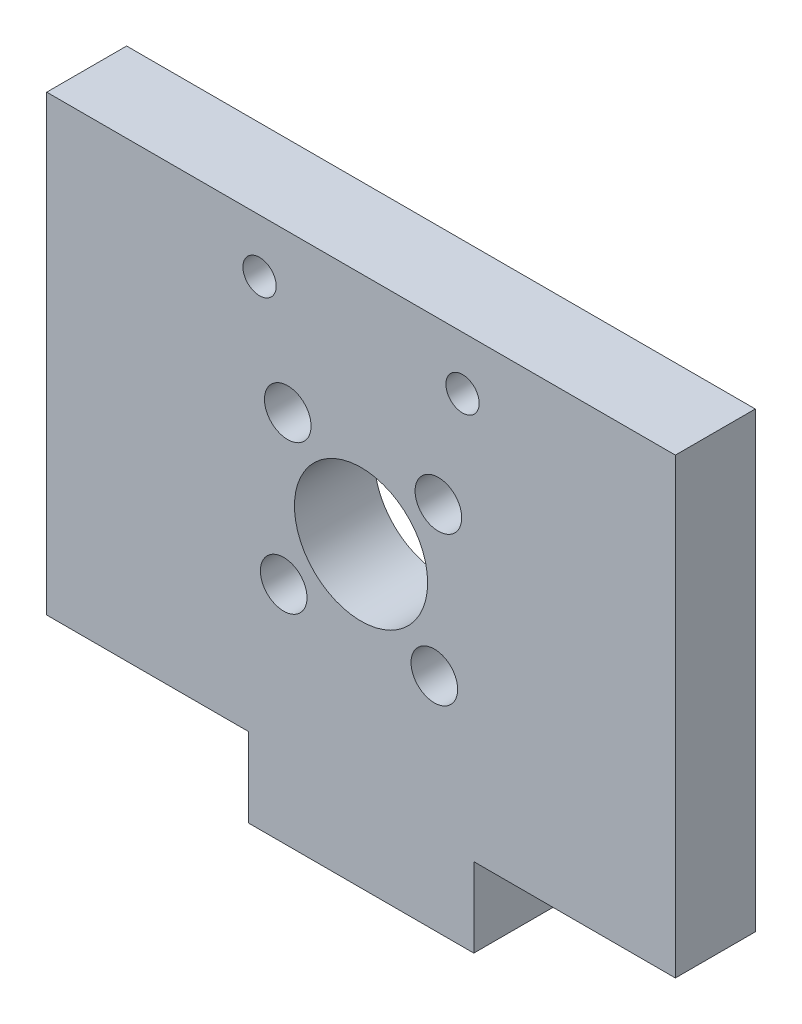
ISO-10303-21;
HEADER;
FILE_DESCRIPTION(('STEP AP214'),'2;1');
FILE_NAME('part.step','',(''),(''),'','','');
FILE_SCHEMA(('AUTOMOTIVE_DESIGN { 1 0 10303 214 1 1 1 1 }'));
ENDSEC;
DATA;
#1=APPLICATION_CONTEXT('core data for automotive mechanical design processes');
#2=APPLICATION_PROTOCOL_DEFINITION('international standard','automotive_design',2000,#1);
#3=PRODUCT_CONTEXT('',#1,'mechanical');
#4=PRODUCT('Part','Part','',(#3));
#5=PRODUCT_RELATED_PRODUCT_CATEGORY('part','',(#4));
#6=PRODUCT_DEFINITION_FORMATION('','',#4);
#7=PRODUCT_DEFINITION_CONTEXT('part definition',#1,'design');
#8=PRODUCT_DEFINITION('design','',#6,#7);
#9=PRODUCT_DEFINITION_SHAPE('','',#8);
#10=(LENGTH_UNIT() NAMED_UNIT(*) SI_UNIT(.MILLI.,.METRE.));
#11=(NAMED_UNIT(*) PLANE_ANGLE_UNIT() SI_UNIT($,.RADIAN.));
#12=(NAMED_UNIT(*) SI_UNIT($,.STERADIAN.) SOLID_ANGLE_UNIT());
#13=UNCERTAINTY_MEASURE_WITH_UNIT(LENGTH_MEASURE(1.E-05),#10,'distance_accuracy_value','');
#14=(GEOMETRIC_REPRESENTATION_CONTEXT(3) GLOBAL_UNCERTAINTY_ASSIGNED_CONTEXT((#13)) GLOBAL_UNIT_ASSIGNED_CONTEXT((#10,
#11,#12)) REPRESENTATION_CONTEXT('',''));
#15=CARTESIAN_POINT('',(0.,0.,0.));
#16=DIRECTION('',(0.,0.,1.));
#17=DIRECTION('',(1.,0.,0.));
#18=AXIS2_PLACEMENT_3D('',#15,#16,#17);
#19=CARTESIAN_POINT('',(0.,0.,6.));
#20=DIRECTION('',(0.,0.,1.));
#21=DIRECTION('',(1.,0.,0.));
#22=AXIS2_PLACEMENT_3D('',#19,#20,#21);
#23=PLANE('',#22);
#24=CARTESIAN_POINT('',(332.936937195696,256.998518153976,6.));
#25=DIRECTION('',(0.,0.,1.));
#26=DIRECTION('',(1.,0.,0.));
#27=AXIS2_PLACEMENT_3D('',#24,#25,#26);
#28=CIRCLE('',#27,1.24999999999996);
#29=CARTESIAN_POINT('',(334.186937195696,256.998518153976,6.));
#30=VERTEX_POINT('',#29);
#31=EDGE_CURVE('E217',#30,#30,#28,.T.);
#32=ORIENTED_EDGE('',*,*,#31,.F.);
#33=EDGE_LOOP('',(#32));
#34=FACE_BOUND('',#33,.T.);
#35=CARTESIAN_POINT('',(317.696937195697,256.998518153976,6.));
#36=DIRECTION('',(0.,0.,1.));
#37=DIRECTION('',(1.,0.,0.));
#38=AXIS2_PLACEMENT_3D('',#35,#36,#37);
#39=CIRCLE('',#38,1.24999999999996);
#40=CARTESIAN_POINT('',(318.946937195696,256.998518153976,6.));
#41=VERTEX_POINT('',#40);
#42=EDGE_CURVE('E211',#41,#41,#39,.T.);
#43=ORIENTED_EDGE('',*,*,#42,.F.);
#44=EDGE_LOOP('',(#43));
#45=FACE_BOUND('',#44,.T.);
#46=CARTESIAN_POINT('',(319.509928142575,237.895914601387,6.));
#47=DIRECTION('',(0.,0.,1.));
#48=DIRECTION('',(1.,0.,0.));
#49=AXIS2_PLACEMENT_3D('',#46,#47,#48);
#50=CIRCLE('',#49,1.74999999999992);
#51=CARTESIAN_POINT('',(321.259928142575,237.895914601387,6.));
#52=VERTEX_POINT('',#51);
#53=EDGE_CURVE('E194',#52,#52,#50,.T.);
#54=ORIENTED_EDGE('',*,*,#53,.F.);
#55=EDGE_LOOP('',(#54));
#56=FACE_BOUND('',#55,.T.);
#57=CARTESIAN_POINT('',(331.123946248819,248.901121706565,6.));
#58=DIRECTION('',(0.,0.,1.));
#59=DIRECTION('',(1.,0.,0.));
#60=AXIS2_PLACEMENT_3D('',#57,#58,#59);
#61=CIRCLE('',#60,1.75000000000008);
#62=CARTESIAN_POINT('',(332.873946248819,248.901121706565,6.));
#63=VERTEX_POINT('',#62);
#64=EDGE_CURVE('E182',#63,#63,#61,.T.);
#65=ORIENTED_EDGE('',*,*,#64,.F.);
#66=EDGE_LOOP('',(#65));
#67=FACE_BOUND('',#66,.T.);
#68=DIRECTION('',(1.,0.,0.));
#69=VECTOR('',#68,1.);
#70=CARTESIAN_POINT('',(333.783603862363,226.998518153976,6.));
#71=LINE('',#70,#69);
#72=CARTESIAN_POINT('',(333.783603862363,226.998518153976,6.));
#73=VERTEX_POINT('',#72);
#74=CARTESIAN_POINT('',(348.916937195697,226.998518153976,6.));
#75=VERTEX_POINT('',#74);
#76=EDGE_CURVE('E145',#73,#75,#71,.T.);
#77=ORIENTED_EDGE('',*,*,#76,.T.);
#78=DIRECTION('',(0.,1.,0.));
#79=VECTOR('',#78,1.);
#80=CARTESIAN_POINT('',(348.916937195697,226.998518153976,6.));
#81=LINE('',#80,#79);
#82=CARTESIAN_POINT('',(348.916937195697,260.998518153976,6.));
#83=VERTEX_POINT('',#82);
#84=EDGE_CURVE('E93',#75,#83,#81,.T.);
#85=ORIENTED_EDGE('',*,*,#84,.T.);
#86=DIRECTION('',(-1.,0.,0.));
#87=VECTOR('',#86,1.);
#88=CARTESIAN_POINT('',(348.916937195697,260.998518153976,6.));
#89=LINE('',#88,#87);
#90=CARTESIAN_POINT('',(301.716937195697,260.998518153976,6.));
#91=VERTEX_POINT('',#90);
#92=EDGE_CURVE('E160',#83,#91,#89,.T.);
#93=ORIENTED_EDGE('',*,*,#92,.T.);
#94=DIRECTION('',(0.,-1.,0.));
#95=VECTOR('',#94,1.);
#96=CARTESIAN_POINT('',(301.716937195697,260.998518153976,6.));
#97=LINE('',#96,#95);
#98=CARTESIAN_POINT('',(301.716937195697,226.998518153976,6.));
#99=VERTEX_POINT('',#98);
#100=EDGE_CURVE('E173',#91,#99,#97,.T.);
#101=ORIENTED_EDGE('',*,*,#100,.T.);
#102=DIRECTION('',(1.,0.,0.));
#103=VECTOR('',#102,1.);
#104=CARTESIAN_POINT('',(301.716937195697,226.998518153976,6.));
#105=LINE('',#104,#103);
#106=CARTESIAN_POINT('',(316.85027052903,226.998518153976,6.));
#107=VERTEX_POINT('',#106);
#108=EDGE_CURVE('E112',#99,#107,#105,.T.);
#109=ORIENTED_EDGE('',*,*,#108,.T.);
#110=DIRECTION('',(0.,-1.,0.));
#111=VECTOR('',#110,1.);
#112=CARTESIAN_POINT('',(316.85027052903,226.998518153976,6.));
#113=LINE('',#112,#111);
#114=CARTESIAN_POINT('',(316.85027052903,221.049077869644,6.));
#115=VERTEX_POINT('',#114);
#116=EDGE_CURVE('E106',#107,#115,#113,.T.);
#117=ORIENTED_EDGE('',*,*,#116,.T.);
#118=DIRECTION('',(1.,0.,0.));
#119=VECTOR('',#118,1.);
#120=CARTESIAN_POINT('',(316.85027052903,221.049077869644,6.));
#121=LINE('',#120,#119);
#122=CARTESIAN_POINT('',(333.783603862363,221.049077869644,6.));
#123=VERTEX_POINT('',#122);
#124=EDGE_CURVE('E110',#115,#123,#121,.T.);
#125=ORIENTED_EDGE('',*,*,#124,.T.);
#126=DIRECTION('',(0.,1.,0.));
#127=VECTOR('',#126,1.);
#128=CARTESIAN_POINT('',(333.783603862363,221.049077869644,6.));
#129=LINE('',#128,#127);
#130=EDGE_CURVE('E50',#123,#73,#129,.T.);
#131=ORIENTED_EDGE('',*,*,#130,.T.);
#132=EDGE_LOOP('',(#77,#85,#93,#101,#109,#117,#125,#131));
#133=FACE_BOUND('',#132,.T.);
#134=CARTESIAN_POINT('',(325.316937195697,243.398518153976,6.));
#135=DIRECTION('',(0.,0.,1.));
#136=DIRECTION('',(1.,0.,0.));
#137=AXIS2_PLACEMENT_3D('',#134,#135,#136);
#138=CIRCLE('',#137,5.);
#139=CARTESIAN_POINT('',(330.316937195697,243.398518153976,6.));
#140=VERTEX_POINT('',#139);
#141=EDGE_CURVE('E134',#140,#140,#138,.T.);
#142=ORIENTED_EDGE('',*,*,#141,.F.);
#143=EDGE_LOOP('',(#142));
#144=FACE_BOUND('',#143,.T.);
#145=CARTESIAN_POINT('',(319.814333643109,249.205527207098,6.));
#146=DIRECTION('',(0.,0.,1.));
#147=DIRECTION('',(1.,0.,0.));
#148=AXIS2_PLACEMENT_3D('',#145,#146,#147);
#149=CIRCLE('',#148,1.75000000000002);
#150=CARTESIAN_POINT('',(321.564333643109,249.205527207098,6.));
#151=VERTEX_POINT('',#150);
#152=EDGE_CURVE('E188',#151,#151,#149,.T.);
#153=ORIENTED_EDGE('',*,*,#152,.F.);
#154=EDGE_LOOP('',(#153));
#155=FACE_BOUND('',#154,.T.);
#156=CARTESIAN_POINT('',(330.819540748286,237.591509100854,6.));
#157=DIRECTION('',(0.,0.,1.));
#158=DIRECTION('',(1.,0.,0.));
#159=AXIS2_PLACEMENT_3D('',#156,#157,#158);
#160=CIRCLE('',#159,1.75000000000001);
#161=CARTESIAN_POINT('',(332.569540748286,237.591509100854,6.));
#162=VERTEX_POINT('',#161);
#163=EDGE_CURVE('E200',#162,#162,#160,.T.);
#164=ORIENTED_EDGE('',*,*,#163,.F.);
#165=EDGE_LOOP('',(#164));
#166=FACE_BOUND('',#165,.T.);
#167=ADVANCED_FACE('F33',(#34,#45,#56,#67,#133,#144,#155,#166),#23,.T.);
#168=CARTESIAN_POINT('',(0.,0.,0.));
#169=DIRECTION('',(0.,0.,1.));
#170=DIRECTION('',(1.,0.,0.));
#171=AXIS2_PLACEMENT_3D('',#168,#169,#170);
#172=PLANE('',#171);
#173=CARTESIAN_POINT('',(332.936937195696,256.998518153976,0.));
#174=DIRECTION('',(0.,0.,1.));
#175=DIRECTION('',(1.,0.,0.));
#176=AXIS2_PLACEMENT_3D('',#173,#174,#175);
#177=CIRCLE('',#176,1.24999999999996);
#178=CARTESIAN_POINT('',(334.186937195696,256.998518153976,0.));
#179=VERTEX_POINT('',#178);
#180=EDGE_CURVE('E214',#179,#179,#177,.F.);
#181=ORIENTED_EDGE('',*,*,#180,.F.);
#182=EDGE_LOOP('',(#181));
#183=FACE_BOUND('',#182,.T.);
#184=CARTESIAN_POINT('',(317.696937195697,256.998518153976,0.));
#185=DIRECTION('',(0.,0.,1.));
#186=DIRECTION('',(1.,0.,0.));
#187=AXIS2_PLACEMENT_3D('',#184,#185,#186);
#188=CIRCLE('',#187,1.24999999999996);
#189=CARTESIAN_POINT('',(318.946937195696,256.998518153976,0.));
#190=VERTEX_POINT('',#189);
#191=EDGE_CURVE('E206',#190,#190,#188,.F.);
#192=ORIENTED_EDGE('',*,*,#191,.F.);
#193=EDGE_LOOP('',(#192));
#194=FACE_BOUND('',#193,.T.);
#195=DIRECTION('',(1.,0.,0.));
#196=VECTOR('',#195,1.);
#197=CARTESIAN_POINT('',(333.783603862363,226.998518153976,0.));
#198=LINE('',#197,#196);
#199=CARTESIAN_POINT('',(333.783603862363,226.998518153976,0.));
#200=VERTEX_POINT('',#199);
#201=CARTESIAN_POINT('',(348.916937195697,226.998518153976,0.));
#202=VERTEX_POINT('',#201);
#203=EDGE_CURVE('E130',#200,#202,#198,.T.);
#204=ORIENTED_EDGE('',*,*,#203,.F.);
#205=DIRECTION('',(0.,1.,0.));
#206=VECTOR('',#205,1.);
#207=CARTESIAN_POINT('',(333.783603862363,221.049077869644,0.));
#208=LINE('',#207,#206);
#209=CARTESIAN_POINT('',(333.783603862363,221.049077869644,0.));
#210=VERTEX_POINT('',#209);
#211=EDGE_CURVE('E85',#210,#200,#208,.T.);
#212=ORIENTED_EDGE('',*,*,#211,.F.);
#213=DIRECTION('',(1.,0.,0.));
#214=VECTOR('',#213,1.);
#215=CARTESIAN_POINT('',(316.85027052903,221.049077869644,0.));
#216=LINE('',#215,#214);
#217=CARTESIAN_POINT('',(316.85027052903,221.049077869644,0.));
#218=VERTEX_POINT('',#217);
#219=EDGE_CURVE('E79',#218,#210,#216,.T.);
#220=ORIENTED_EDGE('',*,*,#219,.F.);
#221=DIRECTION('',(0.,-1.,0.));
#222=VECTOR('',#221,1.);
#223=CARTESIAN_POINT('',(316.85027052903,226.998518153976,0.));
#224=LINE('',#223,#222);
#225=CARTESIAN_POINT('',(316.85027052903,226.998518153976,0.));
#226=VERTEX_POINT('',#225);
#227=EDGE_CURVE('E120',#226,#218,#224,.T.);
#228=ORIENTED_EDGE('',*,*,#227,.F.);
#229=DIRECTION('',(1.,0.,0.));
#230=VECTOR('',#229,1.);
#231=CARTESIAN_POINT('',(301.716937195697,226.998518153976,0.));
#232=LINE('',#231,#230);
#233=CARTESIAN_POINT('',(301.716937195697,226.998518153976,0.));
#234=VERTEX_POINT('',#233);
#235=EDGE_CURVE('E140',#234,#226,#232,.T.);
#236=ORIENTED_EDGE('',*,*,#235,.F.);
#237=DIRECTION('',(0.,-1.,0.));
#238=VECTOR('',#237,1.);
#239=CARTESIAN_POINT('',(301.716937195697,260.998518153976,0.));
#240=LINE('',#239,#238);
#241=CARTESIAN_POINT('',(301.716937195697,260.998518153976,0.));
#242=VERTEX_POINT('',#241);
#243=EDGE_CURVE('E138',#242,#234,#240,.T.);
#244=ORIENTED_EDGE('',*,*,#243,.F.);
#245=DIRECTION('',(-1.,0.,0.));
#246=VECTOR('',#245,1.);
#247=CARTESIAN_POINT('',(348.916937195697,260.998518153976,0.));
#248=LINE('',#247,#246);
#249=CARTESIAN_POINT('',(348.916937195697,260.998518153976,0.));
#250=VERTEX_POINT('',#249);
#251=EDGE_CURVE('E136',#250,#242,#248,.T.);
#252=ORIENTED_EDGE('',*,*,#251,.F.);
#253=DIRECTION('',(0.,1.,0.));
#254=VECTOR('',#253,1.);
#255=CARTESIAN_POINT('',(348.916937195697,226.998518153976,0.));
#256=LINE('',#255,#254);
#257=EDGE_CURVE('E133',#202,#250,#256,.T.);
#258=ORIENTED_EDGE('',*,*,#257,.F.);
#259=EDGE_LOOP('',(#204,#212,#220,#228,#236,#244,#252,#258));
#260=FACE_BOUND('',#259,.T.);
#261=CARTESIAN_POINT('',(325.316937195697,243.398518153976,0.));
#262=DIRECTION('',(0.,0.,1.));
#263=DIRECTION('',(1.,0.,0.));
#264=AXIS2_PLACEMENT_3D('',#261,#262,#263);
#265=CIRCLE('',#264,5.);
#266=CARTESIAN_POINT('',(330.316937195697,243.398518153976,0.));
#267=VERTEX_POINT('',#266);
#268=EDGE_CURVE('E179',#267,#267,#265,.T.);
#269=ORIENTED_EDGE('',*,*,#268,.T.);
#270=EDGE_LOOP('',(#269));
#271=FACE_BOUND('',#270,.T.);
#272=CARTESIAN_POINT('',(331.123946248819,248.901121706565,0.));
#273=DIRECTION('',(0.,0.,1.));
#274=DIRECTION('',(1.,0.,0.));
#275=AXIS2_PLACEMENT_3D('',#272,#273,#274);
#276=CIRCLE('',#275,1.75000000000008);
#277=CARTESIAN_POINT('',(332.873946248819,248.901121706565,0.));
#278=VERTEX_POINT('',#277);
#279=EDGE_CURVE('E185',#278,#278,#276,.T.);
#280=ORIENTED_EDGE('',*,*,#279,.T.);
#281=EDGE_LOOP('',(#280));
#282=FACE_BOUND('',#281,.T.);
#283=CARTESIAN_POINT('',(319.814333643109,249.205527207098,0.));
#284=DIRECTION('',(0.,0.,1.));
#285=DIRECTION('',(1.,0.,0.));
#286=AXIS2_PLACEMENT_3D('',#283,#284,#285);
#287=CIRCLE('',#286,1.75000000000002);
#288=CARTESIAN_POINT('',(321.564333643109,249.205527207098,0.));
#289=VERTEX_POINT('',#288);
#290=EDGE_CURVE('E191',#289,#289,#287,.T.);
#291=ORIENTED_EDGE('',*,*,#290,.T.);
#292=EDGE_LOOP('',(#291));
#293=FACE_BOUND('',#292,.T.);
#294=CARTESIAN_POINT('',(319.509928142575,237.895914601387,0.));
#295=DIRECTION('',(0.,0.,1.));
#296=DIRECTION('',(1.,0.,0.));
#297=AXIS2_PLACEMENT_3D('',#294,#295,#296);
#298=CIRCLE('',#297,1.74999999999992);
#299=CARTESIAN_POINT('',(321.259928142575,237.895914601387,0.));
#300=VERTEX_POINT('',#299);
#301=EDGE_CURVE('E197',#300,#300,#298,.T.);
#302=ORIENTED_EDGE('',*,*,#301,.T.);
#303=EDGE_LOOP('',(#302));
#304=FACE_BOUND('',#303,.T.);
#305=CARTESIAN_POINT('',(330.819540748286,237.591509100854,0.));
#306=DIRECTION('',(0.,0.,1.));
#307=DIRECTION('',(1.,0.,0.));
#308=AXIS2_PLACEMENT_3D('',#305,#306,#307);
#309=CIRCLE('',#308,1.75000000000001);
#310=CARTESIAN_POINT('',(332.569540748286,237.591509100854,0.));
#311=VERTEX_POINT('',#310);
#312=EDGE_CURVE('E203',#311,#311,#309,.T.);
#313=ORIENTED_EDGE('',*,*,#312,.T.);
#314=EDGE_LOOP('',(#313));
#315=FACE_BOUND('',#314,.T.);
#316=ADVANCED_FACE('F164',(#183,#194,#260,#271,#282,#293,#304,#315),#172,.F.);
#317=CARTESIAN_POINT('',(333.783603862363,226.998518153976,6.));
#318=DIRECTION('',(0.,1.,0.));
#319=DIRECTION('',(0.,0.,1.));
#320=AXIS2_PLACEMENT_3D('',#317,#318,#319);
#321=PLANE('',#320);
#322=ORIENTED_EDGE('',*,*,#203,.T.);
#323=DIRECTION('',(0.,0.,-1.));
#324=VECTOR('',#323,1.);
#325=CARTESIAN_POINT('',(348.916937195697,226.998518153976,6.));
#326=LINE('',#325,#324);
#327=EDGE_CURVE('E11',#75,#202,#326,.T.);
#328=ORIENTED_EDGE('',*,*,#327,.F.);
#329=ORIENTED_EDGE('',*,*,#76,.F.);
#330=DIRECTION('',(0.,0.,-1.));
#331=VECTOR('',#330,1.);
#332=CARTESIAN_POINT('',(333.783603862363,226.998518153976,6.));
#333=LINE('',#332,#331);
#334=EDGE_CURVE('E126',#73,#200,#333,.T.);
#335=ORIENTED_EDGE('',*,*,#334,.T.);
#336=EDGE_LOOP('',(#322,#328,#329,#335));
#337=FACE_BOUND('',#336,.T.);
#338=ADVANCED_FACE('F35',(#337),#321,.F.);
#339=CARTESIAN_POINT('',(348.916937195697,226.998518153976,6.));
#340=DIRECTION('',(-1.,0.,0.));
#341=DIRECTION('',(0.,0.,1.));
#342=AXIS2_PLACEMENT_3D('',#339,#340,#341);
#343=PLANE('',#342);
#344=ORIENTED_EDGE('',*,*,#257,.T.);
#345=DIRECTION('',(0.,0.,-1.));
#346=VECTOR('',#345,1.);
#347=CARTESIAN_POINT('',(348.916937195697,260.998518153976,6.));
#348=LINE('',#347,#346);
#349=EDGE_CURVE('E42',#83,#250,#348,.T.);
#350=ORIENTED_EDGE('',*,*,#349,.F.);
#351=ORIENTED_EDGE('',*,*,#84,.F.);
#352=ORIENTED_EDGE('',*,*,#327,.T.);
#353=EDGE_LOOP('',(#344,#350,#351,#352));
#354=FACE_BOUND('',#353,.T.);
#355=ADVANCED_FACE('F285',(#354),#343,.F.);
#356=CARTESIAN_POINT('',(348.916937195697,260.998518153976,6.));
#357=DIRECTION('',(0.,-1.,0.));
#358=DIRECTION('',(1.,0.,0.));
#359=AXIS2_PLACEMENT_3D('',#356,#357,#358);
#360=PLANE('',#359);
#361=ORIENTED_EDGE('',*,*,#251,.T.);
#362=DIRECTION('',(0.,0.,-1.));
#363=VECTOR('',#362,1.);
#364=CARTESIAN_POINT('',(301.716937195697,260.998518153976,6.));
#365=LINE('',#364,#363);
#366=EDGE_CURVE('E152',#91,#242,#365,.T.);
#367=ORIENTED_EDGE('',*,*,#366,.F.);
#368=ORIENTED_EDGE('',*,*,#92,.F.);
#369=ORIENTED_EDGE('',*,*,#349,.T.);
#370=EDGE_LOOP('',(#361,#367,#368,#369));
#371=FACE_BOUND('',#370,.T.);
#372=ADVANCED_FACE('F158',(#371),#360,.F.);
#373=CARTESIAN_POINT('',(301.716937195697,260.998518153976,6.));
#374=DIRECTION('',(1.,0.,0.));
#375=DIRECTION('',(0.,0.,-1.));
#376=AXIS2_PLACEMENT_3D('',#373,#374,#375);
#377=PLANE('',#376);
#378=ORIENTED_EDGE('',*,*,#243,.T.);
#379=DIRECTION('',(0.,0.,-1.));
#380=VECTOR('',#379,1.);
#381=CARTESIAN_POINT('',(301.716937195697,226.998518153976,6.));
#382=LINE('',#381,#380);
#383=EDGE_CURVE('E149',#99,#234,#382,.T.);
#384=ORIENTED_EDGE('',*,*,#383,.F.);
#385=ORIENTED_EDGE('',*,*,#100,.F.);
#386=ORIENTED_EDGE('',*,*,#366,.T.);
#387=EDGE_LOOP('',(#378,#384,#385,#386));
#388=FACE_BOUND('',#387,.T.);
#389=ADVANCED_FACE('F169',(#388),#377,.F.);
#390=CARTESIAN_POINT('',(301.716937195697,226.998518153976,6.));
#391=DIRECTION('',(0.,1.,0.));
#392=DIRECTION('',(0.,0.,1.));
#393=AXIS2_PLACEMENT_3D('',#390,#391,#392);
#394=PLANE('',#393);
#395=ORIENTED_EDGE('',*,*,#235,.T.);
#396=DIRECTION('',(0.,0.,-1.));
#397=VECTOR('',#396,1.);
#398=CARTESIAN_POINT('',(316.85027052903,226.998518153976,6.));
#399=LINE('',#398,#397);
#400=EDGE_CURVE('E121',#107,#226,#399,.T.);
#401=ORIENTED_EDGE('',*,*,#400,.F.);
#402=ORIENTED_EDGE('',*,*,#108,.F.);
#403=ORIENTED_EDGE('',*,*,#383,.T.);
#404=EDGE_LOOP('',(#395,#401,#402,#403));
#405=FACE_BOUND('',#404,.T.);
#406=ADVANCED_FACE('F172',(#405),#394,.F.);
#407=CARTESIAN_POINT('',(316.85027052903,226.998518153976,6.));
#408=DIRECTION('',(1.,0.,0.));
#409=DIRECTION('',(0.,0.,-1.));
#410=AXIS2_PLACEMENT_3D('',#407,#408,#409);
#411=PLANE('',#410);
#412=ORIENTED_EDGE('',*,*,#227,.T.);
#413=DIRECTION('',(0.,0.,-1.));
#414=VECTOR('',#413,1.);
#415=CARTESIAN_POINT('',(316.85027052903,221.049077869644,6.));
#416=LINE('',#415,#414);
#417=EDGE_CURVE('E117',#115,#218,#416,.T.);
#418=ORIENTED_EDGE('',*,*,#417,.F.);
#419=ORIENTED_EDGE('',*,*,#116,.F.);
#420=ORIENTED_EDGE('',*,*,#400,.T.);
#421=EDGE_LOOP('',(#412,#418,#419,#420));
#422=FACE_BOUND('',#421,.T.);
#423=ADVANCED_FACE('F118',(#422),#411,.F.);
#424=CARTESIAN_POINT('',(316.85027052903,221.049077869644,6.));
#425=DIRECTION('',(0.,1.,0.));
#426=DIRECTION('',(0.,0.,1.));
#427=AXIS2_PLACEMENT_3D('',#424,#425,#426);
#428=PLANE('',#427);
#429=ORIENTED_EDGE('',*,*,#219,.T.);
#430=DIRECTION('',(0.,0.,-1.));
#431=VECTOR('',#430,1.);
#432=CARTESIAN_POINT('',(333.783603862363,221.049077869644,6.));
#433=LINE('',#432,#431);
#434=EDGE_CURVE('E122',#123,#210,#433,.T.);
#435=ORIENTED_EDGE('',*,*,#434,.F.);
#436=ORIENTED_EDGE('',*,*,#124,.F.);
#437=ORIENTED_EDGE('',*,*,#417,.T.);
#438=EDGE_LOOP('',(#429,#435,#436,#437));
#439=FACE_BOUND('',#438,.T.);
#440=ADVANCED_FACE('F124',(#439),#428,.F.);
#441=CARTESIAN_POINT('',(333.783603862363,221.049077869644,6.));
#442=DIRECTION('',(-1.,0.,0.));
#443=DIRECTION('',(0.,0.,1.));
#444=AXIS2_PLACEMENT_3D('',#441,#442,#443);
#445=PLANE('',#444);
#446=ORIENTED_EDGE('',*,*,#211,.T.);
#447=ORIENTED_EDGE('',*,*,#334,.F.);
#448=ORIENTED_EDGE('',*,*,#130,.F.);
#449=ORIENTED_EDGE('',*,*,#434,.T.);
#450=EDGE_LOOP('',(#446,#447,#448,#449));
#451=FACE_BOUND('',#450,.T.);
#452=ADVANCED_FACE('F271',(#451),#445,.F.);
#453=CARTESIAN_POINT('',(325.316937195697,243.398518153976,6.));
#454=DIRECTION('',(0.,0.,-1.));
#455=DIRECTION('',(-1.,0.,0.));
#456=AXIS2_PLACEMENT_3D('',#453,#454,#455);
#457=CYLINDRICAL_SURFACE('',#456,5.);
#458=ORIENTED_EDGE('',*,*,#141,.T.);
#459=EDGE_LOOP('',(#458));
#460=FACE_BOUND('',#459,.T.);
#461=ORIENTED_EDGE('',*,*,#268,.F.);
#462=EDGE_LOOP('',(#461));
#463=FACE_BOUND('',#462,.T.);
#464=ADVANCED_FACE('F237',(#460,#463),#457,.F.);
#465=CARTESIAN_POINT('',(331.123946248819,248.901121706565,6.));
#466=DIRECTION('',(0.,0.,-1.));
#467=DIRECTION('',(-1.,0.,0.));
#468=AXIS2_PLACEMENT_3D('',#465,#466,#467);
#469=CYLINDRICAL_SURFACE('',#468,1.75000000000008);
#470=ORIENTED_EDGE('',*,*,#64,.T.);
#471=EDGE_LOOP('',(#470));
#472=FACE_BOUND('',#471,.T.);
#473=ORIENTED_EDGE('',*,*,#279,.F.);
#474=EDGE_LOOP('',(#473));
#475=FACE_BOUND('',#474,.T.);
#476=ADVANCED_FACE('F233',(#472,#475),#469,.F.);
#477=CARTESIAN_POINT('',(319.814333643109,249.205527207098,6.));
#478=DIRECTION('',(0.,0.,-1.));
#479=DIRECTION('',(-1.,0.,0.));
#480=AXIS2_PLACEMENT_3D('',#477,#478,#479);
#481=CYLINDRICAL_SURFACE('',#480,1.75000000000002);
#482=ORIENTED_EDGE('',*,*,#152,.T.);
#483=EDGE_LOOP('',(#482));
#484=FACE_BOUND('',#483,.T.);
#485=ORIENTED_EDGE('',*,*,#290,.F.);
#486=EDGE_LOOP('',(#485));
#487=FACE_BOUND('',#486,.T.);
#488=ADVANCED_FACE('F236',(#484,#487),#481,.F.);
#489=CARTESIAN_POINT('',(319.509928142575,237.895914601387,6.));
#490=DIRECTION('',(0.,0.,-1.));
#491=DIRECTION('',(-1.,0.,0.));
#492=AXIS2_PLACEMENT_3D('',#489,#490,#491);
#493=CYLINDRICAL_SURFACE('',#492,1.74999999999992);
#494=ORIENTED_EDGE('',*,*,#53,.T.);
#495=EDGE_LOOP('',(#494));
#496=FACE_BOUND('',#495,.T.);
#497=ORIENTED_EDGE('',*,*,#301,.F.);
#498=EDGE_LOOP('',(#497));
#499=FACE_BOUND('',#498,.T.);
#500=ADVANCED_FACE('F254',(#496,#499),#493,.F.);
#501=CARTESIAN_POINT('',(330.819540748286,237.591509100854,6.));
#502=DIRECTION('',(0.,0.,-1.));
#503=DIRECTION('',(-1.,0.,0.));
#504=AXIS2_PLACEMENT_3D('',#501,#502,#503);
#505=CYLINDRICAL_SURFACE('',#504,1.75000000000001);
#506=ORIENTED_EDGE('',*,*,#163,.T.);
#507=EDGE_LOOP('',(#506));
#508=FACE_BOUND('',#507,.T.);
#509=ORIENTED_EDGE('',*,*,#312,.F.);
#510=EDGE_LOOP('',(#509));
#511=FACE_BOUND('',#510,.T.);
#512=ADVANCED_FACE('F251',(#508,#511),#505,.F.);
#513=CARTESIAN_POINT('',(317.696937195697,256.998518153976,-0.00100000000000013));
#514=DIRECTION('',(0.,0.,1.));
#515=DIRECTION('',(1.,0.,0.));
#516=AXIS2_PLACEMENT_3D('',#513,#514,#515);
#517=CYLINDRICAL_SURFACE('',#516,1.24999999999996);
#518=ORIENTED_EDGE('',*,*,#42,.T.);
#519=EDGE_LOOP('',(#518));
#520=FACE_BOUND('',#519,.T.);
#521=ORIENTED_EDGE('',*,*,#191,.T.);
#522=EDGE_LOOP('',(#521));
#523=FACE_BOUND('',#522,.T.);
#524=ADVANCED_FACE('F253',(#520,#523),#517,.F.);
#525=CARTESIAN_POINT('',(332.936937195696,256.998518153976,-0.00100000000000013));
#526=DIRECTION('',(0.,0.,1.));
#527=DIRECTION('',(1.,0.,0.));
#528=AXIS2_PLACEMENT_3D('',#525,#526,#527);
#529=CYLINDRICAL_SURFACE('',#528,1.24999999999996);
#530=ORIENTED_EDGE('',*,*,#31,.T.);
#531=EDGE_LOOP('',(#530));
#532=FACE_BOUND('',#531,.T.);
#533=ORIENTED_EDGE('',*,*,#180,.T.);
#534=EDGE_LOOP('',(#533));
#535=FACE_BOUND('',#534,.T.);
#536=ADVANCED_FACE('F221',(#532,#535),#529,.F.);
#537=CLOSED_SHELL('',(#167,#316,#338,#355,#372,#389,#406,#423,#440,#452,#464,#476,#488,#500,
#512,#524,#536));
#538=MANIFOLD_SOLID_BREP('B2',#537);
#539=ADVANCED_BREP_SHAPE_REPRESENTATION('',(#18,#538),#14);
#540=SHAPE_DEFINITION_REPRESENTATION(#9,#539);
ENDSEC;
END-ISO-10303-21;
